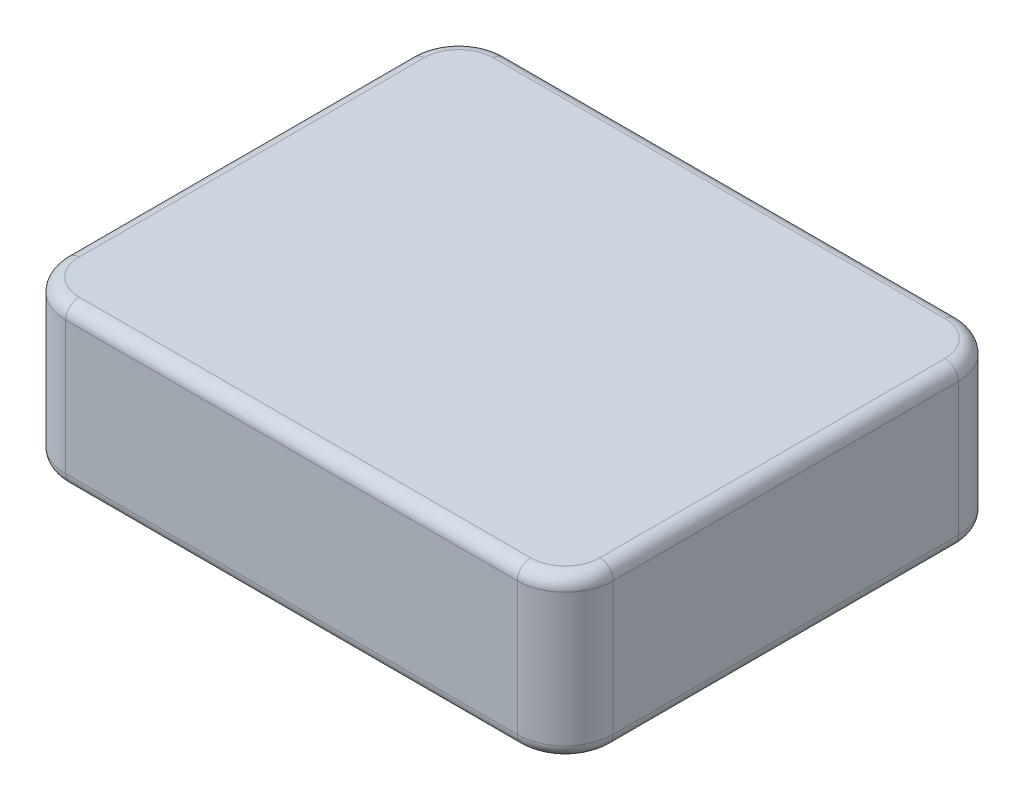
ISO-10303-21;
HEADER;
FILE_DESCRIPTION(('STEP AP214'),'2;1');
FILE_NAME('part.step','',(''),(''),'','','');
FILE_SCHEMA(('AUTOMOTIVE_DESIGN { 1 0 10303 214 1 1 1 1 }'));
ENDSEC;
DATA;
#1=APPLICATION_CONTEXT('core data for automotive mechanical design processes');
#2=APPLICATION_PROTOCOL_DEFINITION('international standard','automotive_design',2000,#1);
#3=PRODUCT_CONTEXT('',#1,'mechanical');
#4=PRODUCT('Part','Part','',(#3));
#5=PRODUCT_RELATED_PRODUCT_CATEGORY('part','',(#4));
#6=PRODUCT_DEFINITION_FORMATION('','',#4);
#7=PRODUCT_DEFINITION_CONTEXT('part definition',#1,'design');
#8=PRODUCT_DEFINITION('design','',#6,#7);
#9=PRODUCT_DEFINITION_SHAPE('','',#8);
#10=(LENGTH_UNIT() NAMED_UNIT(*) SI_UNIT(.MILLI.,.METRE.));
#11=(NAMED_UNIT(*) PLANE_ANGLE_UNIT() SI_UNIT($,.RADIAN.));
#12=(NAMED_UNIT(*) SI_UNIT($,.STERADIAN.) SOLID_ANGLE_UNIT());
#13=UNCERTAINTY_MEASURE_WITH_UNIT(LENGTH_MEASURE(1.E-05),#10,'distance_accuracy_value','');
#14=(GEOMETRIC_REPRESENTATION_CONTEXT(3) GLOBAL_UNCERTAINTY_ASSIGNED_CONTEXT((#13)) GLOBAL_UNIT_ASSIGNED_CONTEXT((#10,
#11,#12)) REPRESENTATION_CONTEXT('',''));
#15=CARTESIAN_POINT('',(0.,0.,0.));
#16=DIRECTION('',(0.,0.,1.));
#17=DIRECTION('',(1.,0.,0.));
#18=AXIS2_PLACEMENT_3D('',#15,#16,#17);
#19=CARTESIAN_POINT('',(16.965,6.,12.965));
#20=DIRECTION('',(0.,-1.,0.));
#21=DIRECTION('',(0.,0.,-1.));
#22=AXIS2_PLACEMENT_3D('',#19,#20,#21);
#23=CYLINDRICAL_SURFACE('',#22,3.6);
#24=DIRECTION('',(0.,-1.,0.));
#25=VECTOR('',#24,1.);
#26=CARTESIAN_POINT('',(16.965,6.,16.565));
#27=LINE('',#26,#25);
#28=CARTESIAN_POINT('',(16.965,5.,16.565));
#29=VERTEX_POINT('',#28);
#30=CARTESIAN_POINT('',(16.965,-5.,16.565));
#31=VERTEX_POINT('',#30);
#32=EDGE_CURVE('E316',#29,#31,#27,.T.);
#33=ORIENTED_EDGE('',*,*,#32,.T.);
#34=CARTESIAN_POINT('',(16.965,-5.,12.965));
#35=DIRECTION('',(0.,1.,0.));
#36=DIRECTION('',(0.,0.,1.));
#37=AXIS2_PLACEMENT_3D('',#34,#35,#36);
#38=CIRCLE('',#37,3.6);
#39=CARTESIAN_POINT('',(20.565,-5.,12.965));
#40=VERTEX_POINT('',#39);
#41=EDGE_CURVE('E265',#31,#40,#38,.T.);
#42=ORIENTED_EDGE('',*,*,#41,.T.);
#43=DIRECTION('',(0.,-1.,0.));
#44=VECTOR('',#43,1.);
#45=CARTESIAN_POINT('',(20.565,6.,12.965));
#46=LINE('',#45,#44);
#47=CARTESIAN_POINT('',(20.565,5.,12.965));
#48=VERTEX_POINT('',#47);
#49=EDGE_CURVE('E180',#48,#40,#46,.T.);
#50=ORIENTED_EDGE('',*,*,#49,.F.);
#51=CARTESIAN_POINT('',(16.965,5.,12.965));
#52=DIRECTION('',(0.,1.,0.));
#53=DIRECTION('',(0.,0.,1.));
#54=AXIS2_PLACEMENT_3D('',#51,#52,#53);
#55=CIRCLE('',#54,3.6);
#56=EDGE_CURVE('E262',#48,#29,#55,.F.);
#57=ORIENTED_EDGE('',*,*,#56,.T.);
#58=EDGE_LOOP('',(#33,#42,#50,#57));
#59=FACE_BOUND('',#58,.T.);
#60=ADVANCED_FACE('F41',(#59),#23,.T.);
#61=CARTESIAN_POINT('',(20.565,6.,12.965));
#62=DIRECTION('',(-1.,0.,0.));
#63=DIRECTION('',(0.,0.,1.));
#64=AXIS2_PLACEMENT_3D('',#61,#62,#63);
#65=PLANE('',#64);
#66=ORIENTED_EDGE('',*,*,#49,.T.);
#67=DIRECTION('',(0.,0.,-1.));
#68=VECTOR('',#67,1.);
#69=CARTESIAN_POINT('',(20.565,-5.,12.965));
#70=LINE('',#69,#68);
#71=CARTESIAN_POINT('',(20.565,-5.,-12.965));
#72=VERTEX_POINT('',#71);
#73=EDGE_CURVE('E178',#40,#72,#70,.T.);
#74=ORIENTED_EDGE('',*,*,#73,.T.);
#75=DIRECTION('',(0.,-1.,0.));
#76=VECTOR('',#75,1.);
#77=CARTESIAN_POINT('',(20.565,6.,-12.965));
#78=LINE('',#77,#76);
#79=CARTESIAN_POINT('',(20.565,5.,-12.965));
#80=VERTEX_POINT('',#79);
#81=EDGE_CURVE('E159',#80,#72,#78,.T.);
#82=ORIENTED_EDGE('',*,*,#81,.F.);
#83=DIRECTION('',(0.,0.,-1.));
#84=VECTOR('',#83,1.);
#85=CARTESIAN_POINT('',(20.565,5.,12.965));
#86=LINE('',#85,#84);
#87=EDGE_CURVE('E175',#80,#48,#86,.F.);
#88=ORIENTED_EDGE('',*,*,#87,.T.);
#89=EDGE_LOOP('',(#66,#74,#82,#88));
#90=FACE_BOUND('',#89,.T.);
#91=ADVANCED_FACE('F173',(#90),#65,.F.);
#92=CARTESIAN_POINT('',(16.965,6.,-12.965));
#93=DIRECTION('',(0.,-1.,0.));
#94=DIRECTION('',(0.,0.,-1.));
#95=AXIS2_PLACEMENT_3D('',#92,#93,#94);
#96=CYLINDRICAL_SURFACE('',#95,3.6);
#97=ORIENTED_EDGE('',*,*,#81,.T.);
#98=CARTESIAN_POINT('',(16.965,-5.,-12.965));
#99=DIRECTION('',(0.,1.,0.));
#100=DIRECTION('',(0.,0.,1.));
#101=AXIS2_PLACEMENT_3D('',#98,#99,#100);
#102=CIRCLE('',#101,3.6);
#103=CARTESIAN_POINT('',(16.965,-5.,-16.565));
#104=VERTEX_POINT('',#103);
#105=EDGE_CURVE('E167',#72,#104,#102,.T.);
#106=ORIENTED_EDGE('',*,*,#105,.T.);
#107=DIRECTION('',(0.,-1.,0.));
#108=VECTOR('',#107,1.);
#109=CARTESIAN_POINT('',(16.965,6.,-16.565));
#110=LINE('',#109,#108);
#111=CARTESIAN_POINT('',(16.965,5.,-16.565));
#112=VERTEX_POINT('',#111);
#113=EDGE_CURVE('E161',#112,#104,#110,.T.);
#114=ORIENTED_EDGE('',*,*,#113,.F.);
#115=CARTESIAN_POINT('',(16.965,5.,-12.965));
#116=DIRECTION('',(0.,1.,0.));
#117=DIRECTION('',(0.,0.,1.));
#118=AXIS2_PLACEMENT_3D('',#115,#116,#117);
#119=CIRCLE('',#118,3.6);
#120=EDGE_CURVE('E156',#112,#80,#119,.F.);
#121=ORIENTED_EDGE('',*,*,#120,.T.);
#122=EDGE_LOOP('',(#97,#106,#114,#121));
#123=FACE_BOUND('',#122,.T.);
#124=ADVANCED_FACE('F158',(#123),#96,.T.);
#125=CARTESIAN_POINT('',(-16.965,6.,-16.565));
#126=DIRECTION('',(0.,0.,1.));
#127=DIRECTION('',(1.,0.,0.));
#128=AXIS2_PLACEMENT_3D('',#125,#126,#127);
#129=PLANE('',#128);
#130=ORIENTED_EDGE('',*,*,#113,.T.);
#131=DIRECTION('',(-1.,0.,0.));
#132=VECTOR('',#131,1.);
#133=CARTESIAN_POINT('',(-16.965,-5.,-16.565));
#134=LINE('',#133,#132);
#135=CARTESIAN_POINT('',(-16.965,-5.,-16.565));
#136=VERTEX_POINT('',#135);
#137=EDGE_CURVE('E234',#104,#136,#134,.T.);
#138=ORIENTED_EDGE('',*,*,#137,.T.);
#139=DIRECTION('',(0.,-1.,0.));
#140=VECTOR('',#139,1.);
#141=CARTESIAN_POINT('',(-16.965,6.,-16.565));
#142=LINE('',#141,#140);
#143=CARTESIAN_POINT('',(-16.965,5.,-16.565));
#144=VERTEX_POINT('',#143);
#145=EDGE_CURVE('E348',#144,#136,#142,.T.);
#146=ORIENTED_EDGE('',*,*,#145,.F.);
#147=DIRECTION('',(-1.,0.,0.));
#148=VECTOR('',#147,1.);
#149=CARTESIAN_POINT('',(16.965,5.,-16.565));
#150=LINE('',#149,#148);
#151=EDGE_CURVE('E231',#144,#112,#150,.F.);
#152=ORIENTED_EDGE('',*,*,#151,.T.);
#153=EDGE_LOOP('',(#130,#138,#146,#152));
#154=FACE_BOUND('',#153,.T.);
#155=ADVANCED_FACE('F345',(#154),#129,.F.);
#156=CARTESIAN_POINT('',(-16.965,6.,-12.965));
#157=DIRECTION('',(0.,-1.,0.));
#158=DIRECTION('',(0.,0.,-1.));
#159=AXIS2_PLACEMENT_3D('',#156,#157,#158);
#160=CYLINDRICAL_SURFACE('',#159,3.6);
#161=ORIENTED_EDGE('',*,*,#145,.T.);
#162=CARTESIAN_POINT('',(-16.965,-5.,-12.965));
#163=DIRECTION('',(0.,1.,0.));
#164=DIRECTION('',(0.,0.,1.));
#165=AXIS2_PLACEMENT_3D('',#162,#163,#164);
#166=CIRCLE('',#165,3.6);
#167=CARTESIAN_POINT('',(-20.565,-5.,-12.965));
#168=VERTEX_POINT('',#167);
#169=EDGE_CURVE('E240',#136,#168,#166,.T.);
#170=ORIENTED_EDGE('',*,*,#169,.T.);
#171=DIRECTION('',(0.,-1.,0.));
#172=VECTOR('',#171,1.);
#173=CARTESIAN_POINT('',(-20.565,6.,-12.965));
#174=LINE('',#173,#172);
#175=CARTESIAN_POINT('',(-20.565,5.,-12.965));
#176=VERTEX_POINT('',#175);
#177=EDGE_CURVE('E352',#176,#168,#174,.T.);
#178=ORIENTED_EDGE('',*,*,#177,.F.);
#179=CARTESIAN_POINT('',(-16.965,5.,-12.965));
#180=DIRECTION('',(0.,1.,0.));
#181=DIRECTION('',(0.,0.,1.));
#182=AXIS2_PLACEMENT_3D('',#179,#180,#181);
#183=CIRCLE('',#182,3.6);
#184=EDGE_CURVE('E237',#176,#144,#183,.F.);
#185=ORIENTED_EDGE('',*,*,#184,.T.);
#186=EDGE_LOOP('',(#161,#170,#178,#185));
#187=FACE_BOUND('',#186,.T.);
#188=ADVANCED_FACE('F402',(#187),#160,.T.);
#189=CARTESIAN_POINT('',(-20.565,6.,12.965));
#190=DIRECTION('',(1.,0.,0.));
#191=DIRECTION('',(0.,0.,-1.));
#192=AXIS2_PLACEMENT_3D('',#189,#190,#191);
#193=PLANE('',#192);
#194=ORIENTED_EDGE('',*,*,#177,.T.);
#195=DIRECTION('',(0.,0.,1.));
#196=VECTOR('',#195,1.);
#197=CARTESIAN_POINT('',(-20.565,-5.,12.965));
#198=LINE('',#197,#196);
#199=CARTESIAN_POINT('',(-20.565,-5.,12.965));
#200=VERTEX_POINT('',#199);
#201=EDGE_CURVE('E246',#168,#200,#198,.T.);
#202=ORIENTED_EDGE('',*,*,#201,.T.);
#203=DIRECTION('',(0.,-1.,0.));
#204=VECTOR('',#203,1.);
#205=CARTESIAN_POINT('',(-20.565,6.,12.965));
#206=LINE('',#205,#204);
#207=CARTESIAN_POINT('',(-20.565,5.,12.965));
#208=VERTEX_POINT('',#207);
#209=EDGE_CURVE('E358',#208,#200,#206,.T.);
#210=ORIENTED_EDGE('',*,*,#209,.F.);
#211=DIRECTION('',(0.,0.,1.));
#212=VECTOR('',#211,1.);
#213=CARTESIAN_POINT('',(-20.565,5.,-12.965));
#214=LINE('',#213,#212);
#215=EDGE_CURVE('E243',#208,#176,#214,.F.);
#216=ORIENTED_EDGE('',*,*,#215,.T.);
#217=EDGE_LOOP('',(#194,#202,#210,#216));
#218=FACE_BOUND('',#217,.T.);
#219=ADVANCED_FACE('F405',(#218),#193,.F.);
#220=CARTESIAN_POINT('',(-16.965,6.,12.965));
#221=DIRECTION('',(0.,-1.,0.));
#222=DIRECTION('',(0.,0.,-1.));
#223=AXIS2_PLACEMENT_3D('',#220,#221,#222);
#224=CYLINDRICAL_SURFACE('',#223,3.6);
#225=ORIENTED_EDGE('',*,*,#209,.T.);
#226=CARTESIAN_POINT('',(-16.965,-5.,12.965));
#227=DIRECTION('',(0.,1.,0.));
#228=DIRECTION('',(0.,0.,1.));
#229=AXIS2_PLACEMENT_3D('',#226,#227,#228);
#230=CIRCLE('',#229,3.6);
#231=CARTESIAN_POINT('',(-16.965,-5.,16.565));
#232=VERTEX_POINT('',#231);
#233=EDGE_CURVE('E252',#200,#232,#230,.T.);
#234=ORIENTED_EDGE('',*,*,#233,.T.);
#235=DIRECTION('',(0.,-1.,0.));
#236=VECTOR('',#235,1.);
#237=CARTESIAN_POINT('',(-16.965,6.,16.565));
#238=LINE('',#237,#236);
#239=CARTESIAN_POINT('',(-16.965,5.,16.565));
#240=VERTEX_POINT('',#239);
#241=EDGE_CURVE('E364',#240,#232,#238,.T.);
#242=ORIENTED_EDGE('',*,*,#241,.F.);
#243=CARTESIAN_POINT('',(-16.965,5.,12.965));
#244=DIRECTION('',(0.,1.,0.));
#245=DIRECTION('',(0.,0.,1.));
#246=AXIS2_PLACEMENT_3D('',#243,#244,#245);
#247=CIRCLE('',#246,3.6);
#248=EDGE_CURVE('E249',#240,#208,#247,.F.);
#249=ORIENTED_EDGE('',*,*,#248,.T.);
#250=EDGE_LOOP('',(#225,#234,#242,#249));
#251=FACE_BOUND('',#250,.T.);
#252=ADVANCED_FACE('F419',(#251),#224,.T.);
#253=CARTESIAN_POINT('',(-16.965,6.,16.565));
#254=DIRECTION('',(0.,0.,-1.));
#255=DIRECTION('',(-1.,0.,0.));
#256=AXIS2_PLACEMENT_3D('',#253,#254,#255);
#257=PLANE('',#256);
#258=ORIENTED_EDGE('',*,*,#241,.T.);
#259=DIRECTION('',(1.,0.,0.));
#260=VECTOR('',#259,1.);
#261=CARTESIAN_POINT('',(-16.965,-5.,16.565));
#262=LINE('',#261,#260);
#263=EDGE_CURVE('E259',#232,#31,#262,.T.);
#264=ORIENTED_EDGE('',*,*,#263,.T.);
#265=ORIENTED_EDGE('',*,*,#32,.F.);
#266=DIRECTION('',(1.,0.,0.));
#267=VECTOR('',#266,1.);
#268=CARTESIAN_POINT('',(-16.965,5.,16.565));
#269=LINE('',#268,#267);
#270=EDGE_CURVE('E255',#29,#240,#269,.F.);
#271=ORIENTED_EDGE('',*,*,#270,.T.);
#272=EDGE_LOOP('',(#258,#264,#265,#271));
#273=FACE_BOUND('',#272,.T.);
#274=ADVANCED_FACE('F420',(#273),#257,.F.);
#275=CARTESIAN_POINT('',(16.965,6.,12.965));
#276=DIRECTION('',(0.,1.,0.));
#277=DIRECTION('',(0.,0.,1.));
#278=AXIS2_PLACEMENT_3D('',#275,#276,#277);
#279=PLANE('',#278);
#280=CARTESIAN_POINT('',(-16.965,6.,12.965));
#281=DIRECTION('',(0.,1.,0.));
#282=DIRECTION('',(0.,0.,1.));
#283=AXIS2_PLACEMENT_3D('',#280,#281,#282);
#284=CIRCLE('',#283,2.6);
#285=CARTESIAN_POINT('',(-19.565,6.,12.965));
#286=VERTEX_POINT('',#285);
#287=CARTESIAN_POINT('',(-16.965,6.,15.565));
#288=VERTEX_POINT('',#287);
#289=EDGE_CURVE('E51',#286,#288,#284,.T.);
#290=ORIENTED_EDGE('',*,*,#289,.T.);
#291=DIRECTION('',(1.,0.,0.));
#292=VECTOR('',#291,1.);
#293=CARTESIAN_POINT('',(16.965,6.,15.565));
#294=LINE('',#293,#292);
#295=CARTESIAN_POINT('',(16.965,6.,15.565));
#296=VERTEX_POINT('',#295);
#297=EDGE_CURVE('E11',#288,#296,#294,.T.);
#298=ORIENTED_EDGE('',*,*,#297,.T.);
#299=CARTESIAN_POINT('',(16.965,6.,12.965));
#300=DIRECTION('',(0.,1.,0.));
#301=DIRECTION('',(0.,0.,1.));
#302=AXIS2_PLACEMENT_3D('',#299,#300,#301);
#303=CIRCLE('',#302,2.6);
#304=CARTESIAN_POINT('',(19.565,6.,12.965));
#305=VERTEX_POINT('',#304);
#306=EDGE_CURVE('E268',#296,#305,#303,.T.);
#307=ORIENTED_EDGE('',*,*,#306,.T.);
#308=DIRECTION('',(0.,0.,-1.));
#309=VECTOR('',#308,1.);
#310=CARTESIAN_POINT('',(19.565,6.,-12.965));
#311=LINE('',#310,#309);
#312=CARTESIAN_POINT('',(19.565,6.,-12.965));
#313=VERTEX_POINT('',#312);
#314=EDGE_CURVE('E271',#305,#313,#311,.T.);
#315=ORIENTED_EDGE('',*,*,#314,.T.);
#316=CARTESIAN_POINT('',(16.965,6.,-12.965));
#317=DIRECTION('',(0.,1.,0.));
#318=DIRECTION('',(0.,0.,1.));
#319=AXIS2_PLACEMENT_3D('',#316,#317,#318);
#320=CIRCLE('',#319,2.6);
#321=CARTESIAN_POINT('',(16.965,6.,-15.565));
#322=VERTEX_POINT('',#321);
#323=EDGE_CURVE('E186',#313,#322,#320,.T.);
#324=ORIENTED_EDGE('',*,*,#323,.T.);
#325=DIRECTION('',(-1.,0.,0.));
#326=VECTOR('',#325,1.);
#327=CARTESIAN_POINT('',(-16.965,6.,-15.565));
#328=LINE('',#327,#326);
#329=CARTESIAN_POINT('',(-16.965,6.,-15.565));
#330=VERTEX_POINT('',#329);
#331=EDGE_CURVE('E276',#322,#330,#328,.T.);
#332=ORIENTED_EDGE('',*,*,#331,.T.);
#333=CARTESIAN_POINT('',(-16.965,6.,-12.965));
#334=DIRECTION('',(0.,1.,0.));
#335=DIRECTION('',(0.,0.,1.));
#336=AXIS2_PLACEMENT_3D('',#333,#334,#335);
#337=CIRCLE('',#336,2.6);
#338=CARTESIAN_POINT('',(-19.565,6.,-12.965));
#339=VERTEX_POINT('',#338);
#340=EDGE_CURVE('E279',#330,#339,#337,.T.);
#341=ORIENTED_EDGE('',*,*,#340,.T.);
#342=DIRECTION('',(0.,0.,1.));
#343=VECTOR('',#342,1.);
#344=CARTESIAN_POINT('',(-19.565,6.,12.965));
#345=LINE('',#344,#343);
#346=EDGE_CURVE('E62',#339,#286,#345,.T.);
#347=ORIENTED_EDGE('',*,*,#346,.T.);
#348=EDGE_LOOP('',(#290,#298,#307,#315,#324,#332,#341,#347));
#349=FACE_BOUND('',#348,.T.);
#350=ADVANCED_FACE('F429',(#349),#279,.T.);
#351=CARTESIAN_POINT('',(16.965,-6.,12.965));
#352=DIRECTION('',(0.,1.,0.));
#353=DIRECTION('',(0.,0.,1.));
#354=AXIS2_PLACEMENT_3D('',#351,#352,#353);
#355=PLANE('',#354);
#356=CARTESIAN_POINT('',(16.965,-6.,-12.965));
#357=DIRECTION('',(0.,1.,0.));
#358=DIRECTION('',(0.,0.,1.));
#359=AXIS2_PLACEMENT_3D('',#356,#357,#358);
#360=CIRCLE('',#359,2.6);
#361=CARTESIAN_POINT('',(16.965,-6.,-15.565));
#362=VERTEX_POINT('',#361);
#363=CARTESIAN_POINT('',(19.565,-6.,-12.965));
#364=VERTEX_POINT('',#363);
#365=EDGE_CURVE('E223',#362,#364,#360,.F.);
#366=ORIENTED_EDGE('',*,*,#365,.T.);
#367=DIRECTION('',(0.,0.,-1.));
#368=VECTOR('',#367,1.);
#369=CARTESIAN_POINT('',(19.565,-6.,12.965));
#370=LINE('',#369,#368);
#371=CARTESIAN_POINT('',(19.565,-6.,12.965));
#372=VERTEX_POINT('',#371);
#373=EDGE_CURVE('E168',#364,#372,#370,.F.);
#374=ORIENTED_EDGE('',*,*,#373,.T.);
#375=CARTESIAN_POINT('',(16.965,-6.,12.965));
#376=DIRECTION('',(0.,1.,0.));
#377=DIRECTION('',(0.,0.,1.));
#378=AXIS2_PLACEMENT_3D('',#375,#376,#377);
#379=CIRCLE('',#378,2.6);
#380=CARTESIAN_POINT('',(16.965,-6.,15.565));
#381=VERTEX_POINT('',#380);
#382=EDGE_CURVE('E202',#372,#381,#379,.F.);
#383=ORIENTED_EDGE('',*,*,#382,.T.);
#384=DIRECTION('',(1.,0.,0.));
#385=VECTOR('',#384,1.);
#386=CARTESIAN_POINT('',(16.965,-6.,15.565));
#387=LINE('',#386,#385);
#388=CARTESIAN_POINT('',(-16.965,-6.,15.565));
#389=VERTEX_POINT('',#388);
#390=EDGE_CURVE('E208',#381,#389,#387,.F.);
#391=ORIENTED_EDGE('',*,*,#390,.T.);
#392=CARTESIAN_POINT('',(-16.965,-6.,12.965));
#393=DIRECTION('',(0.,1.,0.));
#394=DIRECTION('',(0.,0.,1.));
#395=AXIS2_PLACEMENT_3D('',#392,#393,#394);
#396=CIRCLE('',#395,2.6);
#397=CARTESIAN_POINT('',(-19.565,-6.,12.965));
#398=VERTEX_POINT('',#397);
#399=EDGE_CURVE('E211',#389,#398,#396,.F.);
#400=ORIENTED_EDGE('',*,*,#399,.T.);
#401=DIRECTION('',(0.,0.,1.));
#402=VECTOR('',#401,1.);
#403=CARTESIAN_POINT('',(-19.565,-6.,12.965));
#404=LINE('',#403,#402);
#405=CARTESIAN_POINT('',(-19.565,-6.,-12.965));
#406=VERTEX_POINT('',#405);
#407=EDGE_CURVE('E214',#398,#406,#404,.F.);
#408=ORIENTED_EDGE('',*,*,#407,.T.);
#409=CARTESIAN_POINT('',(-16.965,-6.,-12.965));
#410=DIRECTION('',(0.,1.,0.));
#411=DIRECTION('',(0.,0.,1.));
#412=AXIS2_PLACEMENT_3D('',#409,#410,#411);
#413=CIRCLE('',#412,2.6);
#414=CARTESIAN_POINT('',(-16.965,-6.,-15.565));
#415=VERTEX_POINT('',#414);
#416=EDGE_CURVE('E217',#406,#415,#413,.F.);
#417=ORIENTED_EDGE('',*,*,#416,.T.);
#418=DIRECTION('',(-1.,0.,0.));
#419=VECTOR('',#418,1.);
#420=CARTESIAN_POINT('',(16.965,-6.,-15.565));
#421=LINE('',#420,#419);
#422=EDGE_CURVE('E220',#415,#362,#421,.F.);
#423=ORIENTED_EDGE('',*,*,#422,.T.);
#424=EDGE_LOOP('',(#366,#374,#383,#391,#400,#408,#417,#423));
#425=FACE_BOUND('',#424,.T.);
#426=ADVANCED_FACE('F431',(#425),#355,.F.);
#427=CARTESIAN_POINT('',(-19.565,-5.,12.965));
#428=DIRECTION('',(0.,0.,1.));
#429=DIRECTION('',(1.,0.,0.));
#430=AXIS2_PLACEMENT_3D('',#427,#428,#429);
#431=CYLINDRICAL_SURFACE('',#430,1.);
#432=CARTESIAN_POINT('',(-19.565,-5.,-12.965));
#433=DIRECTION('',(0.,0.,-1.));
#434=DIRECTION('',(-1.,0.,0.));
#435=AXIS2_PLACEMENT_3D('',#432,#433,#434);
#436=CIRCLE('',#435,1.);
#437=EDGE_CURVE('E308',#406,#168,#436,.T.);
#438=ORIENTED_EDGE('',*,*,#437,.F.);
#439=ORIENTED_EDGE('',*,*,#407,.F.);
#440=CARTESIAN_POINT('',(-19.565,-5.,12.965));
#441=DIRECTION('',(0.,0.,1.));
#442=DIRECTION('',(1.,0.,0.));
#443=AXIS2_PLACEMENT_3D('',#440,#441,#442);
#444=CIRCLE('',#443,1.);
#445=EDGE_CURVE('E312',#200,#398,#444,.T.);
#446=ORIENTED_EDGE('',*,*,#445,.F.);
#447=ORIENTED_EDGE('',*,*,#201,.F.);
#448=EDGE_LOOP('',(#438,#439,#446,#447));
#449=FACE_BOUND('',#448,.T.);
#450=ADVANCED_FACE('F410',(#449),#431,.T.);
#451=CARTESIAN_POINT('',(-16.965,-5.,12.965));
#452=DIRECTION('',(0.,1.,0.));
#453=DIRECTION('',(0.,0.,1.));
#454=AXIS2_PLACEMENT_3D('',#451,#452,#453);
#455=TOROIDAL_SURFACE('',#454,2.6,1.);
#456=ORIENTED_EDGE('',*,*,#445,.T.);
#457=ORIENTED_EDGE('',*,*,#399,.F.);
#458=CARTESIAN_POINT('',(-16.965,-5.,15.565));
#459=DIRECTION('',(1.,0.,0.));
#460=DIRECTION('',(0.,0.,-1.));
#461=AXIS2_PLACEMENT_3D('',#458,#459,#460);
#462=CIRCLE('',#461,1.);
#463=EDGE_CURVE('E304',#232,#389,#462,.T.);
#464=ORIENTED_EDGE('',*,*,#463,.F.);
#465=ORIENTED_EDGE('',*,*,#233,.F.);
#466=EDGE_LOOP('',(#456,#457,#464,#465));
#467=FACE_BOUND('',#466,.T.);
#468=ADVANCED_FACE('F416',(#467),#455,.T.);
#469=CARTESIAN_POINT('',(-16.965,-5.,-12.965));
#470=DIRECTION('',(0.,1.,0.));
#471=DIRECTION('',(0.,0.,1.));
#472=AXIS2_PLACEMENT_3D('',#469,#470,#471);
#473=TOROIDAL_SURFACE('',#472,2.6,1.);
#474=ORIENTED_EDGE('',*,*,#437,.T.);
#475=ORIENTED_EDGE('',*,*,#169,.F.);
#476=CARTESIAN_POINT('',(-16.965,-5.,-15.565));
#477=DIRECTION('',(1.,0.,0.));
#478=DIRECTION('',(0.,0.,-1.));
#479=AXIS2_PLACEMENT_3D('',#476,#477,#478);
#480=CIRCLE('',#479,1.);
#481=EDGE_CURVE('E300',#415,#136,#480,.T.);
#482=ORIENTED_EDGE('',*,*,#481,.F.);
#483=ORIENTED_EDGE('',*,*,#416,.F.);
#484=EDGE_LOOP('',(#474,#475,#482,#483));
#485=FACE_BOUND('',#484,.T.);
#486=ADVANCED_FACE('F399',(#485),#473,.T.);
#487=CARTESIAN_POINT('',(-16.965,-5.,15.565));
#488=DIRECTION('',(1.,0.,0.));
#489=DIRECTION('',(0.,0.,-1.));
#490=AXIS2_PLACEMENT_3D('',#487,#488,#489);
#491=CYLINDRICAL_SURFACE('',#490,1.);
#492=ORIENTED_EDGE('',*,*,#463,.T.);
#493=ORIENTED_EDGE('',*,*,#390,.F.);
#494=CARTESIAN_POINT('',(16.965,-5.,15.565));
#495=DIRECTION('',(1.,0.,0.));
#496=DIRECTION('',(0.,0.,-1.));
#497=AXIS2_PLACEMENT_3D('',#494,#495,#496);
#498=CIRCLE('',#497,1.);
#499=EDGE_CURVE('E296',#31,#381,#498,.T.);
#500=ORIENTED_EDGE('',*,*,#499,.F.);
#501=ORIENTED_EDGE('',*,*,#263,.F.);
#502=EDGE_LOOP('',(#492,#493,#500,#501));
#503=FACE_BOUND('',#502,.T.);
#504=ADVANCED_FACE('F379',(#503),#491,.T.);
#505=CARTESIAN_POINT('',(-16.965,-5.,-15.565));
#506=DIRECTION('',(-1.,0.,0.));
#507=DIRECTION('',(0.,0.,1.));
#508=AXIS2_PLACEMENT_3D('',#505,#506,#507);
#509=CYLINDRICAL_SURFACE('',#508,1.);
#510=ORIENTED_EDGE('',*,*,#481,.T.);
#511=ORIENTED_EDGE('',*,*,#137,.F.);
#512=CARTESIAN_POINT('',(16.965,-5.,-15.565));
#513=DIRECTION('',(1.,0.,0.));
#514=DIRECTION('',(0.,0.,-1.));
#515=AXIS2_PLACEMENT_3D('',#512,#513,#514);
#516=CIRCLE('',#515,1.);
#517=EDGE_CURVE('E292',#362,#104,#516,.T.);
#518=ORIENTED_EDGE('',*,*,#517,.F.);
#519=ORIENTED_EDGE('',*,*,#422,.F.);
#520=EDGE_LOOP('',(#510,#511,#518,#519));
#521=FACE_BOUND('',#520,.T.);
#522=ADVANCED_FACE('F395',(#521),#509,.T.);
#523=CARTESIAN_POINT('',(16.965,-5.,12.965));
#524=DIRECTION('',(0.,1.,0.));
#525=DIRECTION('',(0.,0.,1.));
#526=AXIS2_PLACEMENT_3D('',#523,#524,#525);
#527=TOROIDAL_SURFACE('',#526,2.6,1.);
#528=ORIENTED_EDGE('',*,*,#499,.T.);
#529=ORIENTED_EDGE('',*,*,#382,.F.);
#530=CARTESIAN_POINT('',(19.565,-5.,12.965));
#531=DIRECTION('',(0.,0.,-1.));
#532=DIRECTION('',(-1.,0.,0.));
#533=AXIS2_PLACEMENT_3D('',#530,#531,#532);
#534=CIRCLE('',#533,1.);
#535=EDGE_CURVE('E289',#40,#372,#534,.T.);
#536=ORIENTED_EDGE('',*,*,#535,.F.);
#537=ORIENTED_EDGE('',*,*,#41,.F.);
#538=EDGE_LOOP('',(#528,#529,#536,#537));
#539=FACE_BOUND('',#538,.T.);
#540=ADVANCED_FACE('F383',(#539),#527,.T.);
#541=CARTESIAN_POINT('',(16.965,-5.,-12.965));
#542=DIRECTION('',(0.,1.,0.));
#543=DIRECTION('',(0.,0.,1.));
#544=AXIS2_PLACEMENT_3D('',#541,#542,#543);
#545=TOROIDAL_SURFACE('',#544,2.6,1.);
#546=ORIENTED_EDGE('',*,*,#517,.T.);
#547=ORIENTED_EDGE('',*,*,#105,.F.);
#548=CARTESIAN_POINT('',(19.565,-5.,-12.965));
#549=DIRECTION('',(0.,0.,1.));
#550=DIRECTION('',(1.,0.,0.));
#551=AXIS2_PLACEMENT_3D('',#548,#549,#550);
#552=CIRCLE('',#551,1.);
#553=EDGE_CURVE('E286',#364,#72,#552,.T.);
#554=ORIENTED_EDGE('',*,*,#553,.F.);
#555=ORIENTED_EDGE('',*,*,#365,.F.);
#556=EDGE_LOOP('',(#546,#547,#554,#555));
#557=FACE_BOUND('',#556,.T.);
#558=ADVANCED_FACE('F391',(#557),#545,.T.);
#559=CARTESIAN_POINT('',(19.565,-5.,12.965));
#560=DIRECTION('',(0.,0.,-1.));
#561=DIRECTION('',(-1.,0.,0.));
#562=AXIS2_PLACEMENT_3D('',#559,#560,#561);
#563=CYLINDRICAL_SURFACE('',#562,1.);
#564=ORIENTED_EDGE('',*,*,#535,.T.);
#565=ORIENTED_EDGE('',*,*,#373,.F.);
#566=ORIENTED_EDGE('',*,*,#553,.T.);
#567=ORIENTED_EDGE('',*,*,#73,.F.);
#568=EDGE_LOOP('',(#564,#565,#566,#567));
#569=FACE_BOUND('',#568,.T.);
#570=ADVANCED_FACE('F386',(#569),#563,.T.);
#571=CARTESIAN_POINT('',(16.965,5.,-15.565));
#572=DIRECTION('',(1.,0.,0.));
#573=DIRECTION('',(0.,0.,-1.));
#574=AXIS2_PLACEMENT_3D('',#571,#572,#573);
#575=CYLINDRICAL_SURFACE('',#574,1.);
#576=CARTESIAN_POINT('',(16.965,5.,-15.565));
#577=DIRECTION('',(1.,0.,0.));
#578=DIRECTION('',(0.,0.,-1.));
#579=AXIS2_PLACEMENT_3D('',#576,#577,#578);
#580=CIRCLE('',#579,1.);
#581=EDGE_CURVE('E330',#112,#322,#580,.T.);
#582=ORIENTED_EDGE('',*,*,#581,.F.);
#583=ORIENTED_EDGE('',*,*,#151,.F.);
#584=CARTESIAN_POINT('',(-16.965,5.,-15.565));
#585=DIRECTION('',(-1.,0.,0.));
#586=DIRECTION('',(0.,0.,1.));
#587=AXIS2_PLACEMENT_3D('',#584,#585,#586);
#588=CIRCLE('',#587,1.);
#589=EDGE_CURVE('E45',#330,#144,#588,.T.);
#590=ORIENTED_EDGE('',*,*,#589,.F.);
#591=ORIENTED_EDGE('',*,*,#331,.F.);
#592=EDGE_LOOP('',(#582,#583,#590,#591));
#593=FACE_BOUND('',#592,.T.);
#594=ADVANCED_FACE('F43',(#593),#575,.T.);
#595=CARTESIAN_POINT('',(-16.965,5.,-12.965));
#596=DIRECTION('',(0.,1.,0.));
#597=DIRECTION('',(0.,0.,1.));
#598=AXIS2_PLACEMENT_3D('',#595,#596,#597);
#599=TOROIDAL_SURFACE('',#598,2.6,1.);
#600=ORIENTED_EDGE('',*,*,#589,.T.);
#601=ORIENTED_EDGE('',*,*,#184,.F.);
#602=CARTESIAN_POINT('',(-19.565,5.,-12.965));
#603=DIRECTION('',(0.,0.,1.));
#604=DIRECTION('',(1.,0.,0.));
#605=AXIS2_PLACEMENT_3D('',#602,#603,#604);
#606=CIRCLE('',#605,1.);
#607=EDGE_CURVE('E190',#339,#176,#606,.T.);
#608=ORIENTED_EDGE('',*,*,#607,.F.);
#609=ORIENTED_EDGE('',*,*,#340,.F.);
#610=EDGE_LOOP('',(#600,#601,#608,#609));
#611=FACE_BOUND('',#610,.T.);
#612=ADVANCED_FACE('F338',(#611),#599,.T.);
#613=CARTESIAN_POINT('',(16.965,5.,-12.965));
#614=DIRECTION('',(0.,1.,0.));
#615=DIRECTION('',(0.,0.,1.));
#616=AXIS2_PLACEMENT_3D('',#613,#614,#615);
#617=TOROIDAL_SURFACE('',#616,2.6,1.);
#618=ORIENTED_EDGE('',*,*,#581,.T.);
#619=ORIENTED_EDGE('',*,*,#323,.F.);
#620=CARTESIAN_POINT('',(19.565,5.,-12.965));
#621=DIRECTION('',(0.,0.,1.));
#622=DIRECTION('',(1.,0.,0.));
#623=AXIS2_PLACEMENT_3D('',#620,#621,#622);
#624=CIRCLE('',#623,1.);
#625=EDGE_CURVE('E184',#80,#313,#624,.T.);
#626=ORIENTED_EDGE('',*,*,#625,.F.);
#627=ORIENTED_EDGE('',*,*,#120,.F.);
#628=EDGE_LOOP('',(#618,#619,#626,#627));
#629=FACE_BOUND('',#628,.T.);
#630=ADVANCED_FACE('F185',(#629),#617,.T.);
#631=CARTESIAN_POINT('',(-19.565,5.,12.965));
#632=DIRECTION('',(0.,0.,-1.));
#633=DIRECTION('',(-1.,0.,0.));
#634=AXIS2_PLACEMENT_3D('',#631,#632,#633);
#635=CYLINDRICAL_SURFACE('',#634,1.);
#636=ORIENTED_EDGE('',*,*,#607,.T.);
#637=ORIENTED_EDGE('',*,*,#215,.F.);
#638=CARTESIAN_POINT('',(-19.565,5.,12.965));
#639=DIRECTION('',(0.,0.,1.));
#640=DIRECTION('',(1.,0.,0.));
#641=AXIS2_PLACEMENT_3D('',#638,#639,#640);
#642=CIRCLE('',#641,1.);
#643=EDGE_CURVE('E191',#286,#208,#642,.T.);
#644=ORIENTED_EDGE('',*,*,#643,.F.);
#645=ORIENTED_EDGE('',*,*,#346,.F.);
#646=EDGE_LOOP('',(#636,#637,#644,#645));
#647=FACE_BOUND('',#646,.T.);
#648=ADVANCED_FACE('F474',(#647),#635,.T.);
#649=CARTESIAN_POINT('',(19.565,5.,12.965));
#650=DIRECTION('',(0.,0.,1.));
#651=DIRECTION('',(1.,0.,0.));
#652=AXIS2_PLACEMENT_3D('',#649,#650,#651);
#653=CYLINDRICAL_SURFACE('',#652,1.);
#654=ORIENTED_EDGE('',*,*,#625,.T.);
#655=ORIENTED_EDGE('',*,*,#314,.F.);
#656=CARTESIAN_POINT('',(19.565,5.,12.965));
#657=DIRECTION('',(0.,0.,1.));
#658=DIRECTION('',(1.,0.,0.));
#659=AXIS2_PLACEMENT_3D('',#656,#657,#658);
#660=CIRCLE('',#659,1.);
#661=EDGE_CURVE('E196',#48,#305,#660,.T.);
#662=ORIENTED_EDGE('',*,*,#661,.F.);
#663=ORIENTED_EDGE('',*,*,#87,.F.);
#664=EDGE_LOOP('',(#654,#655,#662,#663));
#665=FACE_BOUND('',#664,.T.);
#666=ADVANCED_FACE('F194',(#665),#653,.T.);
#667=CARTESIAN_POINT('',(-16.965,5.,12.965));
#668=DIRECTION('',(0.,1.,0.));
#669=DIRECTION('',(0.,0.,1.));
#670=AXIS2_PLACEMENT_3D('',#667,#668,#669);
#671=TOROIDAL_SURFACE('',#670,2.6,1.);
#672=ORIENTED_EDGE('',*,*,#643,.T.);
#673=ORIENTED_EDGE('',*,*,#248,.F.);
#674=CARTESIAN_POINT('',(-16.965,5.,15.565));
#675=DIRECTION('',(1.,0.,0.));
#676=DIRECTION('',(0.,0.,-1.));
#677=AXIS2_PLACEMENT_3D('',#674,#675,#676);
#678=CIRCLE('',#677,1.);
#679=EDGE_CURVE('E320',#288,#240,#678,.T.);
#680=ORIENTED_EDGE('',*,*,#679,.F.);
#681=ORIENTED_EDGE('',*,*,#289,.F.);
#682=EDGE_LOOP('',(#672,#673,#680,#681));
#683=FACE_BOUND('',#682,.T.);
#684=ADVANCED_FACE('F468',(#683),#671,.T.);
#685=CARTESIAN_POINT('',(16.965,5.,12.965));
#686=DIRECTION('',(0.,1.,0.));
#687=DIRECTION('',(0.,0.,1.));
#688=AXIS2_PLACEMENT_3D('',#685,#686,#687);
#689=TOROIDAL_SURFACE('',#688,2.6,1.);
#690=ORIENTED_EDGE('',*,*,#661,.T.);
#691=ORIENTED_EDGE('',*,*,#306,.F.);
#692=CARTESIAN_POINT('',(16.965,5.,15.565));
#693=DIRECTION('',(-1.,0.,0.));
#694=DIRECTION('',(0.,0.,1.));
#695=AXIS2_PLACEMENT_3D('',#692,#693,#694);
#696=CIRCLE('',#695,1.);
#697=EDGE_CURVE('E317',#29,#296,#696,.T.);
#698=ORIENTED_EDGE('',*,*,#697,.F.);
#699=ORIENTED_EDGE('',*,*,#56,.F.);
#700=EDGE_LOOP('',(#690,#691,#698,#699));
#701=FACE_BOUND('',#700,.T.);
#702=ADVANCED_FACE('F428',(#701),#689,.T.);
#703=CARTESIAN_POINT('',(16.965,5.,15.565));
#704=DIRECTION('',(-1.,0.,0.));
#705=DIRECTION('',(0.,0.,1.));
#706=AXIS2_PLACEMENT_3D('',#703,#704,#705);
#707=CYLINDRICAL_SURFACE('',#706,1.);
#708=ORIENTED_EDGE('',*,*,#679,.T.);
#709=ORIENTED_EDGE('',*,*,#270,.F.);
#710=ORIENTED_EDGE('',*,*,#697,.T.);
#711=ORIENTED_EDGE('',*,*,#297,.F.);
#712=EDGE_LOOP('',(#708,#709,#710,#711));
#713=FACE_BOUND('',#712,.T.);
#714=ADVANCED_FACE('F423',(#713),#707,.T.);
#715=CLOSED_SHELL('',(#60,#91,#124,#155,#188,#219,#252,#274,#350,#426,#450,#468,#486,#504,#522,
#540,#558,#570,#594,#612,#630,#648,#666,#684,#702,#714));
#716=MANIFOLD_SOLID_BREP('B2',#715);
#717=ADVANCED_BREP_SHAPE_REPRESENTATION('',(#18,#716),#14);
#718=SHAPE_DEFINITION_REPRESENTATION(#9,#717);
ENDSEC;
END-ISO-10303-21;
